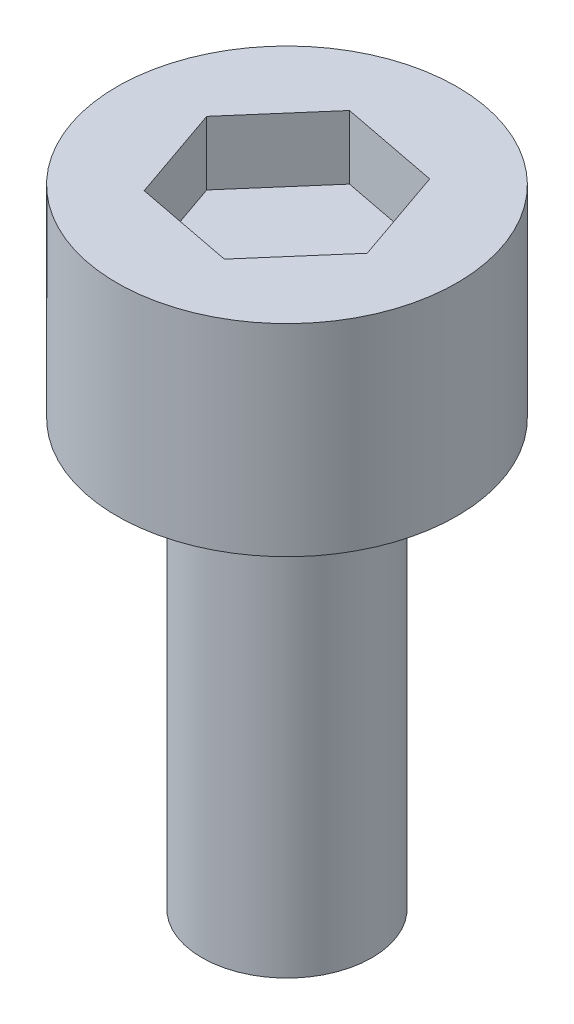
ISO-10303-21;
HEADER;
FILE_DESCRIPTION(('STEP AP214'),'2;1');
FILE_NAME('part.step','',(''),(''),'','','');
FILE_SCHEMA(('AUTOMOTIVE_DESIGN { 1 0 10303 214 1 1 1 1 }'));
ENDSEC;
DATA;
#1=APPLICATION_CONTEXT('core data for automotive mechanical design processes');
#2=APPLICATION_PROTOCOL_DEFINITION('international standard','automotive_design',2000,#1);
#3=PRODUCT_CONTEXT('',#1,'mechanical');
#4=PRODUCT('Part','Part','',(#3));
#5=PRODUCT_RELATED_PRODUCT_CATEGORY('part','',(#4));
#6=PRODUCT_DEFINITION_FORMATION('','',#4);
#7=PRODUCT_DEFINITION_CONTEXT('part definition',#1,'design');
#8=PRODUCT_DEFINITION('design','',#6,#7);
#9=PRODUCT_DEFINITION_SHAPE('','',#8);
#10=(LENGTH_UNIT() NAMED_UNIT(*) SI_UNIT(.MILLI.,.METRE.));
#11=(NAMED_UNIT(*) PLANE_ANGLE_UNIT() SI_UNIT($,.RADIAN.));
#12=(NAMED_UNIT(*) SI_UNIT($,.STERADIAN.) SOLID_ANGLE_UNIT());
#13=UNCERTAINTY_MEASURE_WITH_UNIT(LENGTH_MEASURE(1.E-05),#10,'distance_accuracy_value','');
#14=(GEOMETRIC_REPRESENTATION_CONTEXT(3) GLOBAL_UNCERTAINTY_ASSIGNED_CONTEXT((#13)) GLOBAL_UNIT_ASSIGNED_CONTEXT((#10,
#11,#12)) REPRESENTATION_CONTEXT('',''));
#15=CARTESIAN_POINT('',(0.,0.,0.));
#16=DIRECTION('',(0.,0.,1.));
#17=DIRECTION('',(1.,0.,0.));
#18=AXIS2_PLACEMENT_3D('',#15,#16,#17);
#19=CARTESIAN_POINT('',(0.,0.,0.));
#20=DIRECTION('',(0.,-1.,0.));
#21=DIRECTION('',(0.,0.,-1.));
#22=AXIS2_PLACEMENT_3D('',#19,#20,#21);
#23=PLANE('',#22);
#24=CARTESIAN_POINT('',(0.,0.,0.));
#25=DIRECTION('',(0.,-1.,0.));
#26=DIRECTION('',(0.,0.,-1.));
#27=AXIS2_PLACEMENT_3D('',#24,#25,#26);
#28=CIRCLE('',#27,4.);
#29=CARTESIAN_POINT('',(0.,0.,-4.));
#30=VERTEX_POINT('',#29);
#31=EDGE_CURVE('E11',#30,#30,#28,.T.);
#32=ORIENTED_EDGE('',*,*,#31,.T.);
#33=EDGE_LOOP('',(#32));
#34=FACE_BOUND('',#33,.T.);
#35=ADVANCED_FACE('F33',(#34),#23,.T.);
#36=CARTESIAN_POINT('',(0.,0.,0.));
#37=DIRECTION('',(0.,-1.,0.));
#38=DIRECTION('',(0.,0.,-1.));
#39=AXIS2_PLACEMENT_3D('',#36,#37,#38);
#40=CYLINDRICAL_SURFACE('',#39,4.);
#41=CARTESIAN_POINT('',(0.,20.,0.));
#42=DIRECTION('',(0.,-1.,0.));
#43=DIRECTION('',(0.,0.,-1.));
#44=AXIS2_PLACEMENT_3D('',#41,#42,#43);
#45=CIRCLE('',#44,4.);
#46=CARTESIAN_POINT('',(0.,20.,-4.));
#47=VERTEX_POINT('',#46);
#48=EDGE_CURVE('E40',#47,#47,#45,.T.);
#49=ORIENTED_EDGE('',*,*,#48,.T.);
#50=EDGE_LOOP('',(#49));
#51=FACE_BOUND('',#50,.T.);
#52=ORIENTED_EDGE('',*,*,#31,.F.);
#53=EDGE_LOOP('',(#52));
#54=FACE_BOUND('',#53,.T.);
#55=ADVANCED_FACE('F147',(#51,#54),#40,.T.);
#56=CARTESIAN_POINT('',(4.,20.,0.));
#57=DIRECTION('',(0.,-1.,0.));
#58=DIRECTION('',(0.,0.,-1.));
#59=AXIS2_PLACEMENT_3D('',#56,#57,#58);
#60=PLANE('',#59);
#61=CARTESIAN_POINT('',(0.,20.,0.));
#62=DIRECTION('',(0.,-1.,0.));
#63=DIRECTION('',(0.,0.,-1.));
#64=AXIS2_PLACEMENT_3D('',#61,#62,#63);
#65=CIRCLE('',#64,8.);
#66=CARTESIAN_POINT('',(0.,20.,-8.));
#67=VERTEX_POINT('',#66);
#68=EDGE_CURVE('E142',#67,#67,#65,.T.);
#69=ORIENTED_EDGE('',*,*,#68,.T.);
#70=EDGE_LOOP('',(#69));
#71=FACE_BOUND('',#70,.T.);
#72=ORIENTED_EDGE('',*,*,#48,.F.);
#73=EDGE_LOOP('',(#72));
#74=FACE_BOUND('',#73,.T.);
#75=ADVANCED_FACE('F150',(#71,#74),#60,.T.);
#76=CARTESIAN_POINT('',(0.,0.,0.));
#77=DIRECTION('',(0.,-1.,0.));
#78=DIRECTION('',(0.,0.,-1.));
#79=AXIS2_PLACEMENT_3D('',#76,#77,#78);
#80=CYLINDRICAL_SURFACE('',#79,8.);
#81=CARTESIAN_POINT('',(0.,29.5,0.));
#82=DIRECTION('',(0.,-1.,0.));
#83=DIRECTION('',(0.,0.,-1.));
#84=AXIS2_PLACEMENT_3D('',#81,#82,#83);
#85=CIRCLE('',#84,8.);
#86=CARTESIAN_POINT('',(0.,29.5,-8.));
#87=VERTEX_POINT('',#86);
#88=EDGE_CURVE('E134',#87,#87,#85,.T.);
#89=ORIENTED_EDGE('',*,*,#88,.T.);
#90=EDGE_LOOP('',(#89));
#91=FACE_BOUND('',#90,.T.);
#92=ORIENTED_EDGE('',*,*,#68,.F.);
#93=EDGE_LOOP('',(#92));
#94=FACE_BOUND('',#93,.T.);
#95=ADVANCED_FACE('F152',(#91,#94),#80,.T.);
#96=CARTESIAN_POINT('',(8.,29.5,0.));
#97=DIRECTION('',(0.,1.,0.));
#98=DIRECTION('',(0.,0.,1.));
#99=AXIS2_PLACEMENT_3D('',#96,#97,#98);
#100=PLANE('',#99);
#101=DIRECTION('',(-0.326974595345891,0.,-0.945033128518991));
#102=VECTOR('',#101,1.);
#103=CARTESIAN_POINT('',(4.67630543484689,29.5,0.901763190534081));
#104=LINE('',#103,#102);
#105=CARTESIAN_POINT('',(4.67630543484689,29.5,0.901763190534081));
#106=VERTEX_POINT('',#105);
#107=CARTESIAN_POINT('',(3.11910254862366,29.5,-3.5989177071656));
#108=VERTEX_POINT('',#107);
#109=EDGE_CURVE('E47',#106,#108,#104,.T.);
#110=ORIENTED_EDGE('',*,*,#109,.F.);
#111=DIRECTION('',(0.654935399042385,0.,-0.755684870221174));
#112=VECTOR('',#111,1.);
#113=CARTESIAN_POINT('',(1.55720288622322,29.5,4.50068089769968));
#114=LINE('',#113,#112);
#115=CARTESIAN_POINT('',(1.55720288622322,29.5,4.50068089769968));
#116=VERTEX_POINT('',#115);
#117=EDGE_CURVE('E130',#116,#106,#114,.T.);
#118=ORIENTED_EDGE('',*,*,#117,.F.);
#119=DIRECTION('',(0.981909994388276,0.,0.189348258297817));
#120=VECTOR('',#119,1.);
#121=CARTESIAN_POINT('',(-3.11910254862366,29.5,3.5989177071656));
#122=LINE('',#121,#120);
#123=CARTESIAN_POINT('',(-3.11910254862366,29.5,3.5989177071656));
#124=VERTEX_POINT('',#123);
#125=EDGE_CURVE('E128',#124,#116,#122,.T.);
#126=ORIENTED_EDGE('',*,*,#125,.F.);
#127=DIRECTION('',(0.326974595345891,0.,0.94503312851899));
#128=VECTOR('',#127,1.);
#129=CARTESIAN_POINT('',(-4.67630543484688,29.5,-0.901763190534081));
#130=LINE('',#129,#128);
#131=CARTESIAN_POINT('',(-4.67630543484688,29.5,-0.901763190534081));
#132=VERTEX_POINT('',#131);
#133=EDGE_CURVE('E95',#132,#124,#130,.T.);
#134=ORIENTED_EDGE('',*,*,#133,.F.);
#135=DIRECTION('',(-0.654935399042385,0.,0.755684870221174));
#136=VECTOR('',#135,1.);
#137=CARTESIAN_POINT('',(-1.55720288622322,29.5,-4.50068089769968));
#138=LINE('',#137,#136);
#139=CARTESIAN_POINT('',(-1.55720288622322,29.5,-4.50068089769968));
#140=VERTEX_POINT('',#139);
#141=EDGE_CURVE('E124',#140,#132,#138,.T.);
#142=ORIENTED_EDGE('',*,*,#141,.F.);
#143=DIRECTION('',(-0.981909994388276,0.,-0.189348258297817));
#144=VECTOR('',#143,1.);
#145=CARTESIAN_POINT('',(3.11910254862366,29.5,-3.5989177071656));
#146=LINE('',#145,#144);
#147=EDGE_CURVE('E121',#108,#140,#146,.T.);
#148=ORIENTED_EDGE('',*,*,#147,.F.);
#149=EDGE_LOOP('',(#110,#118,#126,#134,#142,#148));
#150=FACE_BOUND('',#149,.T.);
#151=ORIENTED_EDGE('',*,*,#88,.F.);
#152=EDGE_LOOP('',(#151));
#153=FACE_BOUND('',#152,.T.);
#154=ADVANCED_FACE('F159',(#150,#153),#100,.T.);
#155=CARTESIAN_POINT('',(4.67630543484689,26.5,0.901763190534081));
#156=DIRECTION('',(0.94503312851899,0.,-0.326974595345891));
#157=DIRECTION('',(-0.326974595345891,0.,-0.945033128518991));
#158=AXIS2_PLACEMENT_3D('',#155,#156,#157);
#159=PLANE('',#158);
#160=ORIENTED_EDGE('',*,*,#109,.T.);
#161=DIRECTION('',(0.,1.,0.));
#162=VECTOR('',#161,1.);
#163=CARTESIAN_POINT('',(3.11910254862366,26.5,-3.5989177071656));
#164=LINE('',#163,#162);
#165=CARTESIAN_POINT('',(3.11910254862366,26.5,-3.5989177071656));
#166=VERTEX_POINT('',#165);
#167=EDGE_CURVE('E77',#166,#108,#164,.T.);
#168=ORIENTED_EDGE('',*,*,#167,.F.);
#169=DIRECTION('',(-0.326974595345891,0.,-0.945033128518991));
#170=VECTOR('',#169,1.);
#171=CARTESIAN_POINT('',(4.67630543484689,26.5,0.901763190534081));
#172=LINE('',#171,#170);
#173=CARTESIAN_POINT('',(4.67630543484689,26.5,0.901763190534081));
#174=VERTEX_POINT('',#173);
#175=EDGE_CURVE('E132',#174,#166,#172,.T.);
#176=ORIENTED_EDGE('',*,*,#175,.F.);
#177=DIRECTION('',(0.,1.,0.));
#178=VECTOR('',#177,1.);
#179=CARTESIAN_POINT('',(4.67630543484689,26.5,0.901763190534081));
#180=LINE('',#179,#178);
#181=EDGE_CURVE('E55',#174,#106,#180,.T.);
#182=ORIENTED_EDGE('',*,*,#181,.T.);
#183=EDGE_LOOP('',(#160,#168,#176,#182));
#184=FACE_BOUND('',#183,.T.);
#185=ADVANCED_FACE('F190',(#184),#159,.F.);
#186=CARTESIAN_POINT('',(1.55720288622322,26.5,4.50068089769968));
#187=DIRECTION('',(0.755684870221174,0.,0.654935399042385));
#188=DIRECTION('',(0.654935399042385,0.,-0.755684870221174));
#189=AXIS2_PLACEMENT_3D('',#186,#187,#188);
#190=PLANE('',#189);
#191=ORIENTED_EDGE('',*,*,#117,.T.);
#192=ORIENTED_EDGE('',*,*,#181,.F.);
#193=DIRECTION('',(0.654935399042385,0.,-0.755684870221174));
#194=VECTOR('',#193,1.);
#195=CARTESIAN_POINT('',(1.55720288622322,26.5,4.50068089769968));
#196=LINE('',#195,#194);
#197=CARTESIAN_POINT('',(1.55720288622322,26.5,4.50068089769968));
#198=VERTEX_POINT('',#197);
#199=EDGE_CURVE('E107',#198,#174,#196,.T.);
#200=ORIENTED_EDGE('',*,*,#199,.F.);
#201=DIRECTION('',(0.,1.,0.));
#202=VECTOR('',#201,1.);
#203=CARTESIAN_POINT('',(1.55720288622322,26.5,4.50068089769968));
#204=LINE('',#203,#202);
#205=EDGE_CURVE('E99',#198,#116,#204,.T.);
#206=ORIENTED_EDGE('',*,*,#205,.T.);
#207=EDGE_LOOP('',(#191,#192,#200,#206));
#208=FACE_BOUND('',#207,.T.);
#209=ADVANCED_FACE('F200',(#208),#190,.F.);
#210=CARTESIAN_POINT('',(-3.11910254862366,26.5,3.5989177071656));
#211=DIRECTION('',(-0.189348258297817,0.,0.981909994388275));
#212=DIRECTION('',(0.981909994388276,0.,0.189348258297817));
#213=AXIS2_PLACEMENT_3D('',#210,#211,#212);
#214=PLANE('',#213);
#215=ORIENTED_EDGE('',*,*,#125,.T.);
#216=ORIENTED_EDGE('',*,*,#205,.F.);
#217=DIRECTION('',(0.981909994388276,0.,0.189348258297817));
#218=VECTOR('',#217,1.);
#219=CARTESIAN_POINT('',(-3.11910254862366,26.5,3.5989177071656));
#220=LINE('',#219,#218);
#221=CARTESIAN_POINT('',(-3.11910254862366,26.5,3.5989177071656));
#222=VERTEX_POINT('',#221);
#223=EDGE_CURVE('E103',#222,#198,#220,.T.);
#224=ORIENTED_EDGE('',*,*,#223,.F.);
#225=DIRECTION('',(0.,1.,0.));
#226=VECTOR('',#225,1.);
#227=CARTESIAN_POINT('',(-3.11910254862366,26.5,3.5989177071656));
#228=LINE('',#227,#226);
#229=EDGE_CURVE('E88',#222,#124,#228,.T.);
#230=ORIENTED_EDGE('',*,*,#229,.T.);
#231=EDGE_LOOP('',(#215,#216,#224,#230));
#232=FACE_BOUND('',#231,.T.);
#233=ADVANCED_FACE('F104',(#232),#214,.F.);
#234=CARTESIAN_POINT('',(-4.67630543484688,26.5,-0.901763190534081));
#235=DIRECTION('',(-0.94503312851899,0.,0.326974595345891));
#236=DIRECTION('',(0.326974595345891,0.,0.945033128518991));
#237=AXIS2_PLACEMENT_3D('',#234,#235,#236);
#238=PLANE('',#237);
#239=ORIENTED_EDGE('',*,*,#133,.T.);
#240=ORIENTED_EDGE('',*,*,#229,.F.);
#241=DIRECTION('',(0.326974595345891,0.,0.94503312851899));
#242=VECTOR('',#241,1.);
#243=CARTESIAN_POINT('',(-4.67630543484688,26.5,-0.901763190534081));
#244=LINE('',#243,#242);
#245=CARTESIAN_POINT('',(-4.67630543484688,26.5,-0.901763190534081));
#246=VERTEX_POINT('',#245);
#247=EDGE_CURVE('E92',#246,#222,#244,.T.);
#248=ORIENTED_EDGE('',*,*,#247,.F.);
#249=DIRECTION('',(0.,1.,0.));
#250=VECTOR('',#249,1.);
#251=CARTESIAN_POINT('',(-4.67630543484688,26.5,-0.901763190534081));
#252=LINE('',#251,#250);
#253=EDGE_CURVE('E100',#246,#132,#252,.T.);
#254=ORIENTED_EDGE('',*,*,#253,.T.);
#255=EDGE_LOOP('',(#239,#240,#248,#254));
#256=FACE_BOUND('',#255,.T.);
#257=ADVANCED_FACE('F90',(#256),#238,.F.);
#258=CARTESIAN_POINT('',(-1.55720288622322,26.5,-4.50068089769968));
#259=DIRECTION('',(-0.755684870221174,0.,-0.654935399042385));
#260=DIRECTION('',(-0.654935399042385,0.,0.755684870221174));
#261=AXIS2_PLACEMENT_3D('',#258,#259,#260);
#262=PLANE('',#261);
#263=ORIENTED_EDGE('',*,*,#141,.T.);
#264=ORIENTED_EDGE('',*,*,#253,.F.);
#265=DIRECTION('',(-0.654935399042385,0.,0.755684870221174));
#266=VECTOR('',#265,1.);
#267=CARTESIAN_POINT('',(-1.55720288622322,26.5,-4.50068089769968));
#268=LINE('',#267,#266);
#269=CARTESIAN_POINT('',(-1.55720288622322,26.5,-4.50068089769968));
#270=VERTEX_POINT('',#269);
#271=EDGE_CURVE('E113',#270,#246,#268,.T.);
#272=ORIENTED_EDGE('',*,*,#271,.F.);
#273=DIRECTION('',(0.,1.,0.));
#274=VECTOR('',#273,1.);
#275=CARTESIAN_POINT('',(-1.55720288622322,26.5,-4.50068089769968));
#276=LINE('',#275,#274);
#277=EDGE_CURVE('E137',#270,#140,#276,.T.);
#278=ORIENTED_EDGE('',*,*,#277,.T.);
#279=EDGE_LOOP('',(#263,#264,#272,#278));
#280=FACE_BOUND('',#279,.T.);
#281=ADVANCED_FACE('F225',(#280),#262,.F.);
#282=CARTESIAN_POINT('',(3.11910254862366,26.5,-3.5989177071656));
#283=DIRECTION('',(0.189348258297817,0.,-0.981909994388275));
#284=DIRECTION('',(-0.981909994388276,0.,-0.189348258297817));
#285=AXIS2_PLACEMENT_3D('',#282,#283,#284);
#286=PLANE('',#285);
#287=ORIENTED_EDGE('',*,*,#147,.T.);
#288=ORIENTED_EDGE('',*,*,#277,.F.);
#289=DIRECTION('',(-0.981909994388276,0.,-0.189348258297817));
#290=VECTOR('',#289,1.);
#291=CARTESIAN_POINT('',(3.11910254862366,26.5,-3.5989177071656));
#292=LINE('',#291,#290);
#293=EDGE_CURVE('E115',#166,#270,#292,.T.);
#294=ORIENTED_EDGE('',*,*,#293,.F.);
#295=ORIENTED_EDGE('',*,*,#167,.T.);
#296=EDGE_LOOP('',(#287,#288,#294,#295));
#297=FACE_BOUND('',#296,.T.);
#298=ADVANCED_FACE('F234',(#297),#286,.F.);
#299=CARTESIAN_POINT('',(0.,26.5,0.));
#300=DIRECTION('',(0.,1.,0.));
#301=DIRECTION('',(0.,0.,1.));
#302=AXIS2_PLACEMENT_3D('',#299,#300,#301);
#303=PLANE('',#302);
#304=ORIENTED_EDGE('',*,*,#175,.T.);
#305=ORIENTED_EDGE('',*,*,#293,.T.);
#306=ORIENTED_EDGE('',*,*,#271,.T.);
#307=ORIENTED_EDGE('',*,*,#247,.T.);
#308=ORIENTED_EDGE('',*,*,#223,.T.);
#309=ORIENTED_EDGE('',*,*,#199,.T.);
#310=EDGE_LOOP('',(#304,#305,#306,#307,#308,#309));
#311=FACE_BOUND('',#310,.T.);
#312=ADVANCED_FACE('F110',(#311),#303,.T.);
#313=CLOSED_SHELL('',(#35,#55,#75,#95,#154,#185,#209,#233,#257,#281,#298,#312));
#314=MANIFOLD_SOLID_BREP('B2',#313);
#315=ADVANCED_BREP_SHAPE_REPRESENTATION('',(#18,#314),#14);
#316=SHAPE_DEFINITION_REPRESENTATION(#9,#315);
ENDSEC;
END-ISO-10303-21;
